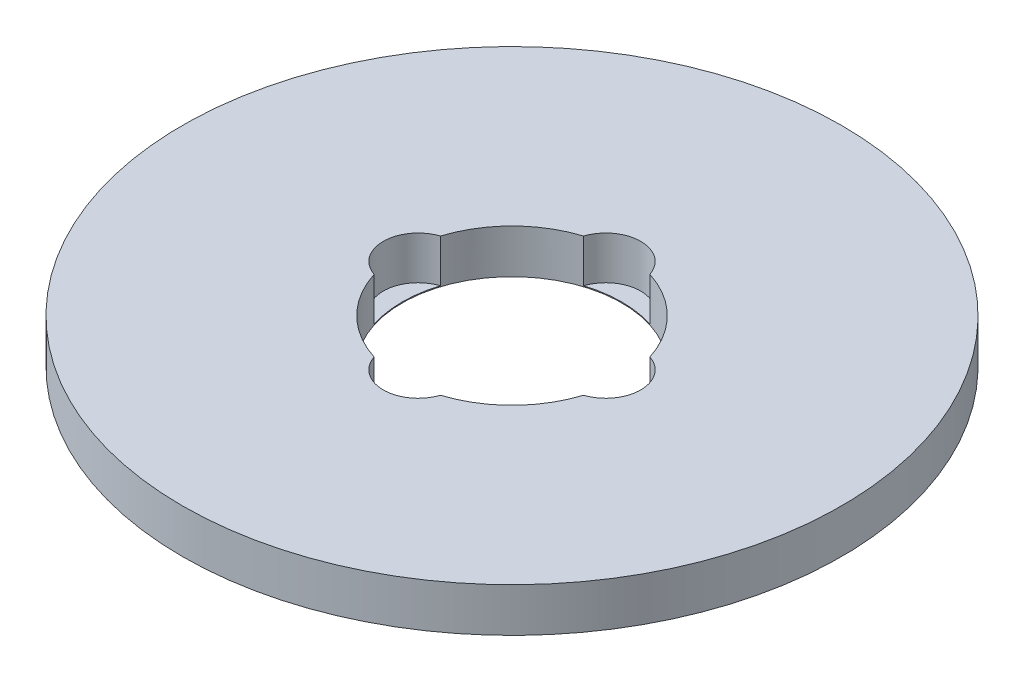
ISO-10303-21;
HEADER;
FILE_DESCRIPTION(('STEP AP214'),'2;1');
FILE_NAME('part.step','',(''),(''),'','','');
FILE_SCHEMA(('AUTOMOTIVE_DESIGN { 1 0 10303 214 1 1 1 1 }'));
ENDSEC;
DATA;
#1=APPLICATION_CONTEXT('core data for automotive mechanical design processes');
#2=APPLICATION_PROTOCOL_DEFINITION('international standard','automotive_design',2000,#1);
#3=PRODUCT_CONTEXT('',#1,'mechanical');
#4=PRODUCT('Part','Part','',(#3));
#5=PRODUCT_RELATED_PRODUCT_CATEGORY('part','',(#4));
#6=PRODUCT_DEFINITION_FORMATION('','',#4);
#7=PRODUCT_DEFINITION_CONTEXT('part definition',#1,'design');
#8=PRODUCT_DEFINITION('design','',#6,#7);
#9=PRODUCT_DEFINITION_SHAPE('','',#8);
#10=(LENGTH_UNIT() NAMED_UNIT(*) SI_UNIT(.MILLI.,.METRE.));
#11=(NAMED_UNIT(*) PLANE_ANGLE_UNIT() SI_UNIT($,.RADIAN.));
#12=(NAMED_UNIT(*) SI_UNIT($,.STERADIAN.) SOLID_ANGLE_UNIT());
#13=UNCERTAINTY_MEASURE_WITH_UNIT(LENGTH_MEASURE(1.E-05),#10,'distance_accuracy_value','');
#14=(GEOMETRIC_REPRESENTATION_CONTEXT(3) GLOBAL_UNCERTAINTY_ASSIGNED_CONTEXT((#13)) GLOBAL_UNIT_ASSIGNED_CONTEXT((#10,
#11,#12)) REPRESENTATION_CONTEXT('',''));
#15=CARTESIAN_POINT('',(0.,0.,0.));
#16=DIRECTION('',(0.,0.,1.));
#17=DIRECTION('',(1.,0.,0.));
#18=AXIS2_PLACEMENT_3D('',#15,#16,#17);
#19=CARTESIAN_POINT('',(0.,4.,0.));
#20=DIRECTION('',(0.,-1.,0.));
#21=DIRECTION('',(0.,0.,-1.));
#22=AXIS2_PLACEMENT_3D('',#19,#20,#21);
#23=CYLINDRICAL_SURFACE('',#22,30.);
#24=CARTESIAN_POINT('',(0.,4.,0.));
#25=DIRECTION('',(0.,1.,0.));
#26=DIRECTION('',(0.,0.,1.));
#27=AXIS2_PLACEMENT_3D('',#24,#25,#26);
#28=CIRCLE('',#27,30.);
#29=CARTESIAN_POINT('',(0.,4.,30.));
#30=VERTEX_POINT('',#29);
#31=EDGE_CURVE('E148',#30,#30,#28,.T.);
#32=ORIENTED_EDGE('',*,*,#31,.F.);
#33=EDGE_LOOP('',(#32));
#34=FACE_BOUND('',#33,.T.);
#35=CARTESIAN_POINT('',(0.,0.,0.));
#36=DIRECTION('',(0.,1.,0.));
#37=DIRECTION('',(0.,0.,1.));
#38=AXIS2_PLACEMENT_3D('',#35,#36,#37);
#39=CIRCLE('',#38,30.);
#40=CARTESIAN_POINT('',(0.,0.,30.));
#41=VERTEX_POINT('',#40);
#42=EDGE_CURVE('E139',#41,#41,#39,.T.);
#43=ORIENTED_EDGE('',*,*,#42,.T.);
#44=EDGE_LOOP('',(#43));
#45=FACE_BOUND('',#44,.T.);
#46=ADVANCED_FACE('F39',(#34,#45),#23,.T.);
#47=CARTESIAN_POINT('',(0.,4.,0.));
#48=DIRECTION('',(0.,1.,0.));
#49=DIRECTION('',(0.,0.,1.));
#50=AXIS2_PLACEMENT_3D('',#47,#48,#49);
#51=PLANE('',#50);
#52=CARTESIAN_POINT('',(0.,4.,8.54136093007077));
#53=DIRECTION('',(0.,1.,0.));
#54=DIRECTION('',(1.,0.,0.));
#55=AXIS2_PLACEMENT_3D('',#52,#53,#54);
#56=CIRCLE('',#55,3.17668369188576);
#57=CARTESIAN_POINT('',(-3.01767330597501,4.,9.53381601555252));
#58=VERTEX_POINT('',#57);
#59=CARTESIAN_POINT('',(3.01767330597508,4.,9.5338160155525));
#60=VERTEX_POINT('',#59);
#61=EDGE_CURVE('E175',#58,#60,#56,.T.);
#62=ORIENTED_EDGE('',*,*,#61,.F.);
#63=CARTESIAN_POINT('',(0.,4.,0.));
#64=DIRECTION('',(0.,1.,0.));
#65=DIRECTION('',(0.,0.,1.));
#66=AXIS2_PLACEMENT_3D('',#63,#64,#65);
#67=CIRCLE('',#66,10.);
#68=CARTESIAN_POINT('',(-9.53381601555251,4.,3.01767330597505));
#69=VERTEX_POINT('',#68);
#70=EDGE_CURVE('E134',#69,#58,#67,.T.);
#71=ORIENTED_EDGE('',*,*,#70,.F.);
#72=CARTESIAN_POINT('',(-8.54136093007077,4.,0.));
#73=DIRECTION('',(0.,1.,0.));
#74=DIRECTION('',(0.,0.,1.));
#75=AXIS2_PLACEMENT_3D('',#72,#73,#74);
#76=CIRCLE('',#75,3.17668369188576);
#77=CARTESIAN_POINT('',(-9.53381601555251,4.,-3.01767330597505));
#78=VERTEX_POINT('',#77);
#79=EDGE_CURVE('E143',#78,#69,#76,.T.);
#80=ORIENTED_EDGE('',*,*,#79,.F.);
#81=CARTESIAN_POINT('',(-3.01767330597515,4.,-9.53381601555248));
#82=VERTEX_POINT('',#81);
#83=EDGE_CURVE('E123',#82,#78,#67,.T.);
#84=ORIENTED_EDGE('',*,*,#83,.F.);
#85=CARTESIAN_POINT('',(0.,4.,-8.54136093007077));
#86=DIRECTION('',(0.,1.,0.));
#87=DIRECTION('',(-1.,0.,0.));
#88=AXIS2_PLACEMENT_3D('',#85,#86,#87);
#89=CIRCLE('',#88,3.17668369188576);
#90=CARTESIAN_POINT('',(3.01767330597495,4.,-9.53381601555255));
#91=VERTEX_POINT('',#90);
#92=EDGE_CURVE('E106',#91,#82,#89,.T.);
#93=ORIENTED_EDGE('',*,*,#92,.F.);
#94=CARTESIAN_POINT('',(9.53381601555251,4.,-3.01767330597505));
#95=VERTEX_POINT('',#94);
#96=EDGE_CURVE('E125',#95,#91,#67,.T.);
#97=ORIENTED_EDGE('',*,*,#96,.F.);
#98=CARTESIAN_POINT('',(8.54136093007077,4.,0.));
#99=DIRECTION('',(0.,1.,0.));
#100=DIRECTION('',(0.,0.,-1.));
#101=AXIS2_PLACEMENT_3D('',#98,#99,#100);
#102=CIRCLE('',#101,3.17668369188576);
#103=CARTESIAN_POINT('',(9.53381601555251,4.,3.01767330597505));
#104=VERTEX_POINT('',#103);
#105=EDGE_CURVE('E286',#104,#95,#102,.T.);
#106=ORIENTED_EDGE('',*,*,#105,.F.);
#107=EDGE_CURVE('E135',#60,#104,#67,.T.);
#108=ORIENTED_EDGE('',*,*,#107,.F.);
#109=EDGE_LOOP('',(#62,#71,#80,#84,#93,#97,#106,#108));
#110=FACE_BOUND('',#109,.T.);
#111=ORIENTED_EDGE('',*,*,#31,.T.);
#112=EDGE_LOOP('',(#111));
#113=FACE_BOUND('',#112,.T.);
#114=ADVANCED_FACE('F118',(#110,#113),#51,.T.);
#115=CARTESIAN_POINT('',(0.,0.,0.));
#116=DIRECTION('',(0.,1.,0.));
#117=DIRECTION('',(0.,0.,1.));
#118=AXIS2_PLACEMENT_3D('',#115,#116,#117);
#119=PLANE('',#118);
#120=CARTESIAN_POINT('',(0.,0.,0.));
#121=DIRECTION('',(0.,1.,0.));
#122=DIRECTION('',(0.,0.,1.));
#123=AXIS2_PLACEMENT_3D('',#120,#121,#122);
#124=CIRCLE('',#123,10.);
#125=CARTESIAN_POINT('',(0.,0.,10.));
#126=VERTEX_POINT('',#125);
#127=EDGE_CURVE('E136',#126,#126,#124,.T.);
#128=ORIENTED_EDGE('',*,*,#127,.T.);
#129=EDGE_LOOP('',(#128));
#130=FACE_BOUND('',#129,.T.);
#131=ORIENTED_EDGE('',*,*,#42,.F.);
#132=EDGE_LOOP('',(#131));
#133=FACE_BOUND('',#132,.T.);
#134=ADVANCED_FACE('F187',(#130,#133),#119,.F.);
#135=CARTESIAN_POINT('',(0.,4.,0.));
#136=DIRECTION('',(0.,-1.,0.));
#137=DIRECTION('',(0.,0.,-1.));
#138=AXIS2_PLACEMENT_3D('',#135,#136,#137);
#139=CYLINDRICAL_SURFACE('',#138,10.);
#140=DIRECTION('',(0.,1.,0.));
#141=VECTOR('',#140,1.);
#142=CARTESIAN_POINT('',(-3.01767330597501,2.0388817551667,9.53381601555252));
#143=LINE('',#142,#141);
#144=CARTESIAN_POINT('',(-3.01767330597501,0.0777635103334038,9.53381601555252));
#145=VERTEX_POINT('',#144);
#146=EDGE_CURVE('E11',#145,#58,#143,.T.);
#147=ORIENTED_EDGE('',*,*,#146,.F.);
#148=CARTESIAN_POINT('',(0.,0.0777635103334038,0.));
#149=DIRECTION('',(0.,1.,0.));
#150=DIRECTION('',(0.,0.,1.));
#151=AXIS2_PLACEMENT_3D('',#148,#149,#150);
#152=CIRCLE('',#151,10.);
#153=CARTESIAN_POINT('',(3.01767330597508,0.0777635103334038,9.5338160155525));
#154=VERTEX_POINT('',#153);
#155=EDGE_CURVE('E170',#145,#154,#152,.T.);
#156=ORIENTED_EDGE('',*,*,#155,.T.);
#157=DIRECTION('',(0.,1.,0.));
#158=VECTOR('',#157,1.);
#159=CARTESIAN_POINT('',(3.01767330597508,2.0388817551667,9.5338160155525));
#160=LINE('',#159,#158);
#161=EDGE_CURVE('E46',#60,#154,#160,.F.);
#162=ORIENTED_EDGE('',*,*,#161,.F.);
#163=ORIENTED_EDGE('',*,*,#107,.T.);
#164=DIRECTION('',(0.,1.,0.));
#165=VECTOR('',#164,1.);
#166=CARTESIAN_POINT('',(9.53381601555251,2.0388817551667,3.01767330597505));
#167=LINE('',#166,#165);
#168=CARTESIAN_POINT('',(9.53381601555251,0.0777635103334038,3.01767330597505));
#169=VERTEX_POINT('',#168);
#170=EDGE_CURVE('E164',#169,#104,#167,.T.);
#171=ORIENTED_EDGE('',*,*,#170,.F.);
#172=CARTESIAN_POINT('',(0.,0.0777635103334038,0.));
#173=DIRECTION('',(0.,1.,0.));
#174=DIRECTION('',(0.,0.,1.));
#175=AXIS2_PLACEMENT_3D('',#172,#173,#174);
#176=CIRCLE('',#175,10.);
#177=CARTESIAN_POINT('',(9.53381601555251,0.0777635103334038,-3.01767330597505));
#178=VERTEX_POINT('',#177);
#179=EDGE_CURVE('E115',#169,#178,#176,.T.);
#180=ORIENTED_EDGE('',*,*,#179,.T.);
#181=DIRECTION('',(0.,1.,0.));
#182=VECTOR('',#181,1.);
#183=CARTESIAN_POINT('',(9.53381601555251,2.0388817551667,-3.01767330597505));
#184=LINE('',#183,#182);
#185=EDGE_CURVE('E131',#95,#178,#184,.F.);
#186=ORIENTED_EDGE('',*,*,#185,.F.);
#187=ORIENTED_EDGE('',*,*,#96,.T.);
#188=DIRECTION('',(0.,1.,0.));
#189=VECTOR('',#188,1.);
#190=CARTESIAN_POINT('',(3.01767330597495,2.0388817551667,-9.53381601555255));
#191=LINE('',#190,#189);
#192=CARTESIAN_POINT('',(3.01767330597495,0.0777635103334038,-9.53381601555255));
#193=VERTEX_POINT('',#192);
#194=EDGE_CURVE('E105',#193,#91,#191,.T.);
#195=ORIENTED_EDGE('',*,*,#194,.F.);
#196=CARTESIAN_POINT('',(0.,0.0777635103334038,0.));
#197=DIRECTION('',(0.,1.,0.));
#198=DIRECTION('',(0.,0.,1.));
#199=AXIS2_PLACEMENT_3D('',#196,#197,#198);
#200=CIRCLE('',#199,10.);
#201=CARTESIAN_POINT('',(-3.01767330597515,0.0777635103334038,-9.53381601555248));
#202=VERTEX_POINT('',#201);
#203=EDGE_CURVE('E159',#193,#202,#200,.T.);
#204=ORIENTED_EDGE('',*,*,#203,.T.);
#205=DIRECTION('',(0.,1.,0.));
#206=VECTOR('',#205,1.);
#207=CARTESIAN_POINT('',(-3.01767330597515,2.0388817551667,-9.53381601555248));
#208=LINE('',#207,#206);
#209=EDGE_CURVE('E114',#82,#202,#208,.F.);
#210=ORIENTED_EDGE('',*,*,#209,.F.);
#211=ORIENTED_EDGE('',*,*,#83,.T.);
#212=DIRECTION('',(0.,1.,0.));
#213=VECTOR('',#212,1.);
#214=CARTESIAN_POINT('',(-9.53381601555251,2.0388817551667,-3.01767330597505));
#215=LINE('',#214,#213);
#216=CARTESIAN_POINT('',(-9.53381601555251,0.0777635103334038,-3.01767330597505));
#217=VERTEX_POINT('',#216);
#218=EDGE_CURVE('E160',#217,#78,#215,.T.);
#219=ORIENTED_EDGE('',*,*,#218,.F.);
#220=CARTESIAN_POINT('',(0.,0.0777635103334038,0.));
#221=DIRECTION('',(0.,1.,0.));
#222=DIRECTION('',(0.,0.,1.));
#223=AXIS2_PLACEMENT_3D('',#220,#221,#222);
#224=CIRCLE('',#223,10.);
#225=CARTESIAN_POINT('',(-9.53381601555251,0.0777635103334038,3.01767330597505));
#226=VERTEX_POINT('',#225);
#227=EDGE_CURVE('E149',#217,#226,#224,.T.);
#228=ORIENTED_EDGE('',*,*,#227,.T.);
#229=DIRECTION('',(0.,1.,0.));
#230=VECTOR('',#229,1.);
#231=CARTESIAN_POINT('',(-9.53381601555251,2.0388817551667,3.01767330597505));
#232=LINE('',#231,#230);
#233=EDGE_CURVE('E152',#69,#226,#232,.F.);
#234=ORIENTED_EDGE('',*,*,#233,.F.);
#235=ORIENTED_EDGE('',*,*,#70,.T.);
#236=EDGE_LOOP('',(#147,#156,#162,#163,#171,#180,#186,#187,#195,#204,#210,#211,#219,#228,#234,#235));
#237=FACE_BOUND('',#236,.T.);
#238=ORIENTED_EDGE('',*,*,#127,.F.);
#239=EDGE_LOOP('',(#238));
#240=FACE_BOUND('',#239,.T.);
#241=ADVANCED_FACE('F126',(#237,#240),#139,.F.);
#242=CARTESIAN_POINT('',(-8.54136093007077,0.0777635103334038,0.));
#243=DIRECTION('',(0.,1.,0.));
#244=DIRECTION('',(0.,0.,1.));
#245=AXIS2_PLACEMENT_3D('',#242,#243,#244);
#246=CYLINDRICAL_SURFACE('',#245,3.17668369188576);
#247=ORIENTED_EDGE('',*,*,#218,.T.);
#248=ORIENTED_EDGE('',*,*,#79,.T.);
#249=ORIENTED_EDGE('',*,*,#233,.T.);
#250=CARTESIAN_POINT('',(-8.54136093007077,0.0777635103334038,0.));
#251=DIRECTION('',(0.,1.,0.));
#252=DIRECTION('',(0.,0.,1.));
#253=AXIS2_PLACEMENT_3D('',#250,#251,#252);
#254=CIRCLE('',#253,3.17668369188576);
#255=EDGE_CURVE('E144',#217,#226,#254,.T.);
#256=ORIENTED_EDGE('',*,*,#255,.F.);
#257=EDGE_LOOP('',(#247,#248,#249,#256));
#258=FACE_BOUND('',#257,.T.);
#259=ADVANCED_FACE('F200',(#258),#246,.F.);
#260=CARTESIAN_POINT('',(-8.54136093007077,0.0777635103334038,0.));
#261=DIRECTION('',(0.,1.,0.));
#262=DIRECTION('',(0.,0.,1.));
#263=AXIS2_PLACEMENT_3D('',#260,#261,#262);
#264=PLANE('',#263);
#265=ORIENTED_EDGE('',*,*,#255,.T.);
#266=ORIENTED_EDGE('',*,*,#227,.F.);
#267=EDGE_LOOP('',(#265,#266));
#268=FACE_BOUND('',#267,.T.);
#269=ADVANCED_FACE('F201',(#268),#264,.T.);
#270=CARTESIAN_POINT('',(0.,0.0777635103334038,-8.54136093007077));
#271=DIRECTION('',(0.,1.,0.));
#272=DIRECTION('',(0.,0.,1.));
#273=AXIS2_PLACEMENT_3D('',#270,#271,#272);
#274=CYLINDRICAL_SURFACE('',#273,3.17668369188576);
#275=ORIENTED_EDGE('',*,*,#194,.T.);
#276=ORIENTED_EDGE('',*,*,#92,.T.);
#277=ORIENTED_EDGE('',*,*,#209,.T.);
#278=CARTESIAN_POINT('',(0.,0.0777635103334038,-8.54136093007077));
#279=DIRECTION('',(0.,1.,0.));
#280=DIRECTION('',(-1.,0.,0.));
#281=AXIS2_PLACEMENT_3D('',#278,#279,#280);
#282=CIRCLE('',#281,3.17668369188576);
#283=EDGE_CURVE('E107',#193,#202,#282,.T.);
#284=ORIENTED_EDGE('',*,*,#283,.F.);
#285=EDGE_LOOP('',(#275,#276,#277,#284));
#286=FACE_BOUND('',#285,.T.);
#287=ADVANCED_FACE('F102',(#286),#274,.F.);
#288=CARTESIAN_POINT('',(0.,0.0777635103334038,-8.54136093007077));
#289=DIRECTION('',(0.,1.,0.));
#290=DIRECTION('',(-1.,0.,0.));
#291=AXIS2_PLACEMENT_3D('',#288,#289,#290);
#292=PLANE('',#291);
#293=ORIENTED_EDGE('',*,*,#283,.T.);
#294=ORIENTED_EDGE('',*,*,#203,.F.);
#295=EDGE_LOOP('',(#293,#294));
#296=FACE_BOUND('',#295,.T.);
#297=ADVANCED_FACE('F209',(#296),#292,.T.);
#298=CARTESIAN_POINT('',(8.54136093007077,0.0777635103334038,0.));
#299=DIRECTION('',(0.,1.,0.));
#300=DIRECTION('',(0.,0.,1.));
#301=AXIS2_PLACEMENT_3D('',#298,#299,#300);
#302=CYLINDRICAL_SURFACE('',#301,3.17668369188576);
#303=ORIENTED_EDGE('',*,*,#170,.T.);
#304=ORIENTED_EDGE('',*,*,#105,.T.);
#305=ORIENTED_EDGE('',*,*,#185,.T.);
#306=CARTESIAN_POINT('',(8.54136093007077,0.0777635103334038,0.));
#307=DIRECTION('',(0.,1.,0.));
#308=DIRECTION('',(0.,0.,-1.));
#309=AXIS2_PLACEMENT_3D('',#306,#307,#308);
#310=CIRCLE('',#309,3.17668369188576);
#311=EDGE_CURVE('E56',#169,#178,#310,.T.);
#312=ORIENTED_EDGE('',*,*,#311,.F.);
#313=EDGE_LOOP('',(#303,#304,#305,#312));
#314=FACE_BOUND('',#313,.T.);
#315=ADVANCED_FACE('F213',(#314),#302,.F.);
#316=CARTESIAN_POINT('',(8.54136093007077,0.0777635103334038,0.));
#317=DIRECTION('',(0.,1.,0.));
#318=DIRECTION('',(0.,0.,-1.));
#319=AXIS2_PLACEMENT_3D('',#316,#317,#318);
#320=PLANE('',#319);
#321=ORIENTED_EDGE('',*,*,#311,.T.);
#322=ORIENTED_EDGE('',*,*,#179,.F.);
#323=EDGE_LOOP('',(#321,#322));
#324=FACE_BOUND('',#323,.T.);
#325=ADVANCED_FACE('F179',(#324),#320,.T.);
#326=CARTESIAN_POINT('',(0.,0.0777635103334038,8.54136093007077));
#327=DIRECTION('',(0.,1.,0.));
#328=DIRECTION('',(0.,0.,1.));
#329=AXIS2_PLACEMENT_3D('',#326,#327,#328);
#330=CYLINDRICAL_SURFACE('',#329,3.17668369188576);
#331=ORIENTED_EDGE('',*,*,#146,.T.);
#332=ORIENTED_EDGE('',*,*,#61,.T.);
#333=ORIENTED_EDGE('',*,*,#161,.T.);
#334=CARTESIAN_POINT('',(0.,0.0777635103334038,8.54136093007077));
#335=DIRECTION('',(0.,1.,0.));
#336=DIRECTION('',(1.,0.,0.));
#337=AXIS2_PLACEMENT_3D('',#334,#335,#336);
#338=CIRCLE('',#337,3.17668369188576);
#339=EDGE_CURVE('E55',#145,#154,#338,.T.);
#340=ORIENTED_EDGE('',*,*,#339,.F.);
#341=EDGE_LOOP('',(#331,#332,#333,#340));
#342=FACE_BOUND('',#341,.T.);
#343=ADVANCED_FACE('F171',(#342),#330,.F.);
#344=CARTESIAN_POINT('',(0.,0.0777635103334038,8.54136093007077));
#345=DIRECTION('',(0.,1.,0.));
#346=DIRECTION('',(1.,0.,0.));
#347=AXIS2_PLACEMENT_3D('',#344,#345,#346);
#348=PLANE('',#347);
#349=ORIENTED_EDGE('',*,*,#339,.T.);
#350=ORIENTED_EDGE('',*,*,#155,.F.);
#351=EDGE_LOOP('',(#349,#350));
#352=FACE_BOUND('',#351,.T.);
#353=ADVANCED_FACE('F173',(#352),#348,.T.);
#354=CLOSED_SHELL('',(#46,#114,#134,#241,#259,#269,#287,#297,#315,#325,#343,#353));
#355=MANIFOLD_SOLID_BREP('B2',#354);
#356=ADVANCED_BREP_SHAPE_REPRESENTATION('',(#18,#355),#14);
#357=SHAPE_DEFINITION_REPRESENTATION(#9,#356);
ENDSEC;
END-ISO-10303-21;
